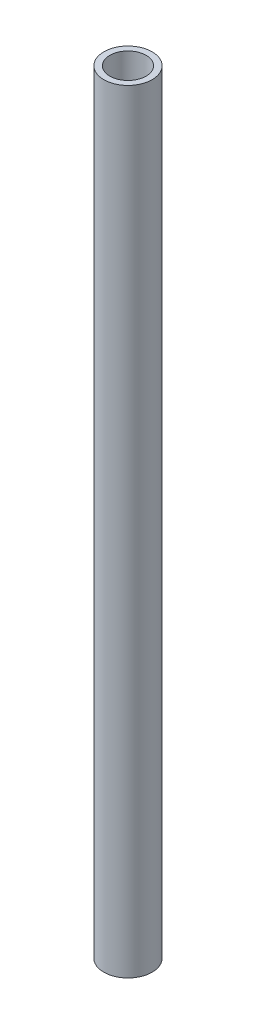
ISO-10303-21;
HEADER;
FILE_DESCRIPTION(('STEP AP214'),'2;1');
FILE_NAME('part.step','',(''),(''),'','','');
FILE_SCHEMA(('AUTOMOTIVE_DESIGN { 1 0 10303 214 1 1 1 1 }'));
ENDSEC;
DATA;
#1=APPLICATION_CONTEXT('core data for automotive mechanical design processes');
#2=APPLICATION_PROTOCOL_DEFINITION('international standard','automotive_design',2000,#1);
#3=PRODUCT_CONTEXT('',#1,'mechanical');
#4=PRODUCT('Part','Part','',(#3));
#5=PRODUCT_RELATED_PRODUCT_CATEGORY('part','',(#4));
#6=PRODUCT_DEFINITION_FORMATION('','',#4);
#7=PRODUCT_DEFINITION_CONTEXT('part definition',#1,'design');
#8=PRODUCT_DEFINITION('design','',#6,#7);
#9=PRODUCT_DEFINITION_SHAPE('','',#8);
#10=(LENGTH_UNIT() NAMED_UNIT(*) SI_UNIT(.MILLI.,.METRE.));
#11=(NAMED_UNIT(*) PLANE_ANGLE_UNIT() SI_UNIT($,.RADIAN.));
#12=(NAMED_UNIT(*) SI_UNIT($,.STERADIAN.) SOLID_ANGLE_UNIT());
#13=UNCERTAINTY_MEASURE_WITH_UNIT(LENGTH_MEASURE(1.E-05),#10,'distance_accuracy_value','');
#14=(GEOMETRIC_REPRESENTATION_CONTEXT(3) GLOBAL_UNCERTAINTY_ASSIGNED_CONTEXT((#13)) GLOBAL_UNIT_ASSIGNED_CONTEXT((#10,
#11,#12)) REPRESENTATION_CONTEXT('',''));
#15=CARTESIAN_POINT('',(0.,0.,0.));
#16=DIRECTION('',(0.,0.,1.));
#17=DIRECTION('',(1.,0.,0.));
#18=AXIS2_PLACEMENT_3D('',#15,#16,#17);
#19=CARTESIAN_POINT('',(-391.18166808322,406.4,-212.743279788072));
#20=DIRECTION('',(0.,1.,0.));
#21=DIRECTION('',(0.,0.,1.));
#22=AXIS2_PLACEMENT_3D('',#19,#20,#21);
#23=PLANE('',#22);
#24=CARTESIAN_POINT('',(-391.18166808322,406.4,-212.743279788072));
#25=DIRECTION('',(0.,1.,0.));
#26=DIRECTION('',(0.,0.,1.));
#27=AXIS2_PLACEMENT_3D('',#24,#25,#26);
#28=CIRCLE('',#27,12.7);
#29=CARTESIAN_POINT('',(-391.18166808322,406.4,-200.043279788072));
#30=VERTEX_POINT('',#29);
#31=EDGE_CURVE('E10',#30,#30,#28,.T.);
#32=ORIENTED_EDGE('',*,*,#31,.T.);
#33=EDGE_LOOP('',(#32));
#34=FACE_BOUND('',#33,.T.);
#35=CARTESIAN_POINT('',(-391.18166808322,406.4,-212.743279788072));
#36=DIRECTION('',(0.,1.,0.));
#37=DIRECTION('',(0.,0.,1.));
#38=AXIS2_PLACEMENT_3D('',#35,#36,#37);
#39=CIRCLE('',#38,9.52500000000002);
#40=CARTESIAN_POINT('',(-391.18166808322,406.4,-203.218279788071));
#41=VERTEX_POINT('',#40);
#42=EDGE_CURVE('E42',#41,#41,#39,.T.);
#43=ORIENTED_EDGE('',*,*,#42,.F.);
#44=EDGE_LOOP('',(#43));
#45=FACE_BOUND('',#44,.T.);
#46=ADVANCED_FACE('F31',(#34,#45),#23,.T.);
#47=CARTESIAN_POINT('',(-391.18166808322,0.,-212.743279788072));
#48=DIRECTION('',(0.,1.,0.));
#49=DIRECTION('',(0.,0.,1.));
#50=AXIS2_PLACEMENT_3D('',#47,#48,#49);
#51=PLANE('',#50);
#52=CARTESIAN_POINT('',(-391.18166808322,0.,-212.743279788072));
#53=DIRECTION('',(0.,1.,0.));
#54=DIRECTION('',(0.,0.,1.));
#55=AXIS2_PLACEMENT_3D('',#52,#53,#54);
#56=CIRCLE('',#55,12.7);
#57=CARTESIAN_POINT('',(-391.18166808322,0.,-200.043279788072));
#58=VERTEX_POINT('',#57);
#59=EDGE_CURVE('E35',#58,#58,#56,.T.);
#60=ORIENTED_EDGE('',*,*,#59,.F.);
#61=EDGE_LOOP('',(#60));
#62=FACE_BOUND('',#61,.T.);
#63=CARTESIAN_POINT('',(-391.18166808322,0.,-212.743279788072));
#64=DIRECTION('',(0.,1.,0.));
#65=DIRECTION('',(0.,0.,1.));
#66=AXIS2_PLACEMENT_3D('',#63,#64,#65);
#67=CIRCLE('',#66,9.52500000000002);
#68=CARTESIAN_POINT('',(-391.18166808322,0.,-203.218279788071));
#69=VERTEX_POINT('',#68);
#70=EDGE_CURVE('E44',#69,#69,#67,.T.);
#71=ORIENTED_EDGE('',*,*,#70,.T.);
#72=EDGE_LOOP('',(#71));
#73=FACE_BOUND('',#72,.T.);
#74=ADVANCED_FACE('F54',(#62,#73),#51,.F.);
#75=CARTESIAN_POINT('',(-391.18166808322,406.4,-212.743279788072));
#76=DIRECTION('',(0.,-1.,0.));
#77=DIRECTION('',(0.,0.,-1.));
#78=AXIS2_PLACEMENT_3D('',#75,#76,#77);
#79=CYLINDRICAL_SURFACE('',#78,12.7);
#80=ORIENTED_EDGE('',*,*,#31,.F.);
#81=EDGE_LOOP('',(#80));
#82=FACE_BOUND('',#81,.T.);
#83=ORIENTED_EDGE('',*,*,#59,.T.);
#84=EDGE_LOOP('',(#83));
#85=FACE_BOUND('',#84,.T.);
#86=ADVANCED_FACE('F33',(#82,#85),#79,.T.);
#87=CARTESIAN_POINT('',(-391.18166808322,406.4,-212.743279788072));
#88=DIRECTION('',(0.,-1.,0.));
#89=DIRECTION('',(0.,0.,-1.));
#90=AXIS2_PLACEMENT_3D('',#87,#88,#89);
#91=CYLINDRICAL_SURFACE('',#90,9.52500000000002);
#92=ORIENTED_EDGE('',*,*,#42,.T.);
#93=EDGE_LOOP('',(#92));
#94=FACE_BOUND('',#93,.T.);
#95=ORIENTED_EDGE('',*,*,#70,.F.);
#96=EDGE_LOOP('',(#95));
#97=FACE_BOUND('',#96,.T.);
#98=ADVANCED_FACE('F50',(#94,#97),#91,.F.);
#99=CLOSED_SHELL('',(#46,#74,#86,#98));
#100=MANIFOLD_SOLID_BREP('B2',#99);
#101=ADVANCED_BREP_SHAPE_REPRESENTATION('',(#18,#100),#14);
#102=SHAPE_DEFINITION_REPRESENTATION(#9,#101);
ENDSEC;
END-ISO-10303-21;
